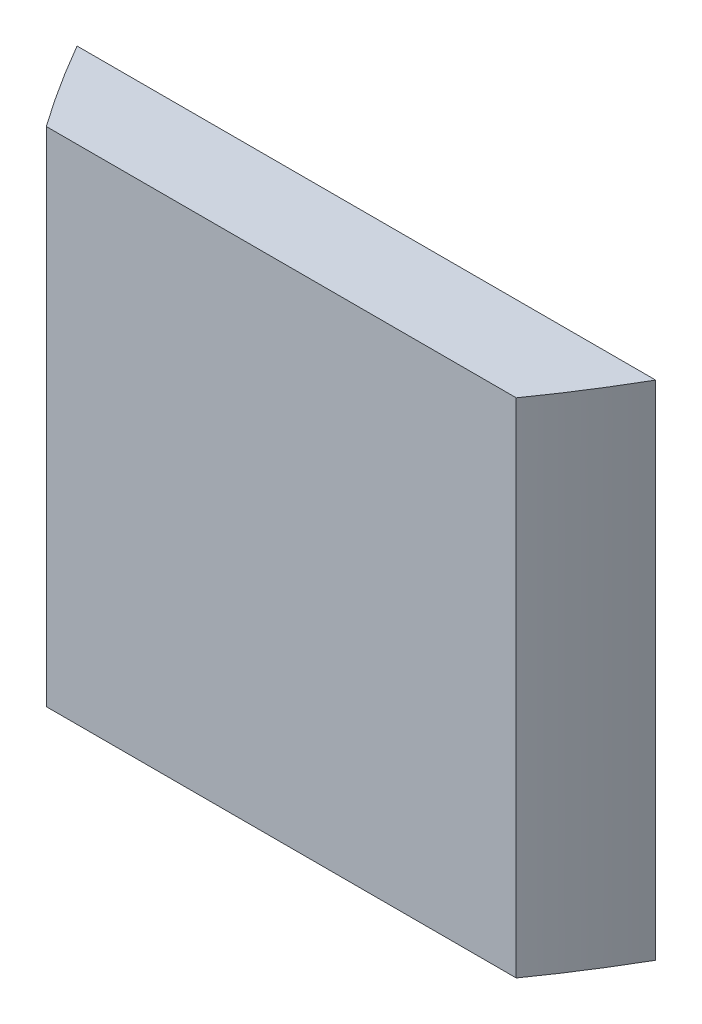
ISO-10303-21;
HEADER;
FILE_DESCRIPTION(('STEP AP214'),'2;1');
FILE_NAME('part.step','',(''),(''),'','','');
FILE_SCHEMA(('AUTOMOTIVE_DESIGN { 1 0 10303 214 1 1 1 1 }'));
ENDSEC;
DATA;
#1=APPLICATION_CONTEXT('core data for automotive mechanical design processes');
#2=APPLICATION_PROTOCOL_DEFINITION('international standard','automotive_design',2000,#1);
#3=PRODUCT_CONTEXT('',#1,'mechanical');
#4=PRODUCT('Part','Part','',(#3));
#5=PRODUCT_RELATED_PRODUCT_CATEGORY('part','',(#4));
#6=PRODUCT_DEFINITION_FORMATION('','',#4);
#7=PRODUCT_DEFINITION_CONTEXT('part definition',#1,'design');
#8=PRODUCT_DEFINITION('design','',#6,#7);
#9=PRODUCT_DEFINITION_SHAPE('','',#8);
#10=(LENGTH_UNIT() NAMED_UNIT(*) SI_UNIT(.MILLI.,.METRE.));
#11=(NAMED_UNIT(*) PLANE_ANGLE_UNIT() SI_UNIT($,.RADIAN.));
#12=(NAMED_UNIT(*) SI_UNIT($,.STERADIAN.) SOLID_ANGLE_UNIT());
#13=UNCERTAINTY_MEASURE_WITH_UNIT(LENGTH_MEASURE(1.E-05),#10,'distance_accuracy_value','');
#14=(GEOMETRIC_REPRESENTATION_CONTEXT(3) GLOBAL_UNCERTAINTY_ASSIGNED_CONTEXT((#13)) GLOBAL_UNIT_ASSIGNED_CONTEXT((#10,
#11,#12)) REPRESENTATION_CONTEXT('',''));
#15=CARTESIAN_POINT('',(0.,0.,0.));
#16=DIRECTION('',(0.,0.,1.));
#17=DIRECTION('',(1.,0.,0.));
#18=AXIS2_PLACEMENT_3D('',#15,#16,#17);
#19=CARTESIAN_POINT('',(-200.000000000337,300.,-6.70196537155832E-10));
#20=CARTESIAN_POINT('',(-5.91540705308091E-11,300.,400.000000000552));
#21=CARTESIAN_POINT('',(200.000000000219,300.,-4.34305369445553E-10));
#22=B_SPLINE_CURVE_WITH_KNOTS('',2,(#19,#20,#21),.UNSPECIFIED.,.F.,.F.,(3,3),(0.056028396232078,
0.943971603767659),.UNSPECIFIED.);
#23=DIRECTION('',(0.,-1.,0.));
#24=VECTOR('',#23,1.);
#25=SURFACE_OF_LINEAR_EXTRUSION('',#22,#24);
#26=CARTESIAN_POINT('',(-200.000000000337,0.,-6.70196537155832E-10));
#27=CARTESIAN_POINT('',(-5.91540705308091E-11,0.,400.000000000552));
#28=CARTESIAN_POINT('',(200.000000000219,0.,-4.34305369445553E-10));
#29=B_SPLINE_CURVE_WITH_KNOTS('',2,(#26,#27,#28),.UNSPECIFIED.,.F.,.F.,(3,3),(0.056028396232078,
0.943971603767659),.UNSPECIFIED.);
#30=CARTESIAN_POINT('',(-172.742583042524,0.,50.7999999994648));
#31=VERTEX_POINT('',#30);
#32=CARTESIAN_POINT('',(-140.285423334384,0.,101.599999999465));
#33=VERTEX_POINT('',#32);
#34=EDGE_CURVE('E89',#31,#33,#29,.T.);
#35=ORIENTED_EDGE('',*,*,#34,.T.);
#36=DIRECTION('',(0.,-1.,0.));
#37=VECTOR('',#36,1.);
#38=CARTESIAN_POINT('',(-140.285423334385,300.,101.599999999465));
#39=LINE('',#38,#37);
#40=CARTESIAN_POINT('',(-140.285423334384,300.,101.599999999465));
#41=VERTEX_POINT('',#40);
#42=EDGE_CURVE('E48',#33,#41,#39,.F.);
#43=ORIENTED_EDGE('',*,*,#42,.T.);
#44=CARTESIAN_POINT('',(-172.742583042524,300.,50.7999999994648));
#45=VERTEX_POINT('',#44);
#46=EDGE_CURVE('E86',#45,#41,#22,.T.);
#47=ORIENTED_EDGE('',*,*,#46,.F.);
#48=DIRECTION('',(0.,-1.,0.));
#49=VECTOR('',#48,1.);
#50=CARTESIAN_POINT('',(-172.742583053825,300.,50.7999999994648));
#51=LINE('',#50,#49);
#52=EDGE_CURVE('E96',#45,#31,#51,.T.);
#53=ORIENTED_EDGE('',*,*,#52,.T.);
#54=EDGE_LOOP('',(#35,#43,#47,#53));
#55=FACE_BOUND('',#54,.T.);
#56=ADVANCED_FACE('F33',(#55),#25,.F.);
#57=CARTESIAN_POINT('',(140.285423334384,300.,101.599999999465));
#58=VERTEX_POINT('',#57);
#59=CARTESIAN_POINT('',(172.742583042523,300.,50.7999999994648));
#60=VERTEX_POINT('',#59);
#61=EDGE_CURVE('E83',#58,#60,#22,.T.);
#62=ORIENTED_EDGE('',*,*,#61,.F.);
#63=DIRECTION('',(0.,-1.,0.));
#64=VECTOR('',#63,1.);
#65=CARTESIAN_POINT('',(140.285423334384,300.,101.599999999465));
#66=LINE('',#65,#64);
#67=CARTESIAN_POINT('',(140.285423334384,0.,101.599999999465));
#68=VERTEX_POINT('',#67);
#69=EDGE_CURVE('E73',#58,#68,#66,.T.);
#70=ORIENTED_EDGE('',*,*,#69,.T.);
#71=CARTESIAN_POINT('',(172.742583042523,0.,50.8000000189873));
#72=VERTEX_POINT('',#71);
#73=EDGE_CURVE('E56',#68,#72,#29,.T.);
#74=ORIENTED_EDGE('',*,*,#73,.T.);
#75=DIRECTION('',(0.,-1.,0.));
#76=VECTOR('',#75,1.);
#77=CARTESIAN_POINT('',(172.742583053825,300.,50.7999999994648));
#78=LINE('',#77,#76);
#79=EDGE_CURVE('E88',#72,#60,#78,.F.);
#80=ORIENTED_EDGE('',*,*,#79,.T.);
#81=EDGE_LOOP('',(#62,#70,#74,#80));
#82=FACE_BOUND('',#81,.T.);
#83=ADVANCED_FACE('F35',(#82),#25,.F.);
#84=CARTESIAN_POINT('',(-5.9161009424713E-11,300.,200.));
#85=DIRECTION('',(0.,-1.,0.));
#86=DIRECTION('',(0.,0.,-1.));
#87=AXIS2_PLACEMENT_3D('',#84,#85,#86);
#88=PLANE('',#87);
#89=ORIENTED_EDGE('',*,*,#46,.T.);
#90=DIRECTION('',(-1.,0.,0.));
#91=VECTOR('',#90,1.);
#92=CARTESIAN_POINT('',(-221.417293167124,300.,101.599999999465));
#93=LINE('',#92,#91);
#94=EDGE_CURVE('E76',#58,#41,#93,.T.);
#95=ORIENTED_EDGE('',*,*,#94,.F.);
#96=ORIENTED_EDGE('',*,*,#61,.T.);
#97=DIRECTION('',(1.,0.,0.));
#98=VECTOR('',#97,1.);
#99=CARTESIAN_POINT('',(-222.676725495858,300.,50.7999999994648));
#100=LINE('',#99,#98);
#101=EDGE_CURVE('E159',#45,#60,#100,.T.);
#102=ORIENTED_EDGE('',*,*,#101,.F.);
#103=EDGE_LOOP('',(#89,#95,#96,#102));
#104=FACE_BOUND('',#103,.T.);
#105=ADVANCED_FACE('F81',(#104),#88,.F.);
#106=CARTESIAN_POINT('',(-5.9161009424713E-11,0.,200.));
#107=DIRECTION('',(0.,-1.,0.));
#108=DIRECTION('',(0.,0.,-1.));
#109=AXIS2_PLACEMENT_3D('',#106,#107,#108);
#110=PLANE('',#109);
#111=DIRECTION('',(1.,0.,0.));
#112=VECTOR('',#111,1.);
#113=CARTESIAN_POINT('',(-5.9161009424713E-11,0.,101.599999999465));
#114=LINE('',#113,#112);
#115=EDGE_CURVE('E11',#33,#68,#114,.T.);
#116=ORIENTED_EDGE('',*,*,#115,.F.);
#117=ORIENTED_EDGE('',*,*,#34,.F.);
#118=DIRECTION('',(-1.,0.,0.));
#119=VECTOR('',#118,1.);
#120=CARTESIAN_POINT('',(-5.9161009424713E-11,0.,50.7999999994648));
#121=LINE('',#120,#119);
#122=EDGE_CURVE('E42',#72,#31,#121,.T.);
#123=ORIENTED_EDGE('',*,*,#122,.F.);
#124=ORIENTED_EDGE('',*,*,#73,.F.);
#125=EDGE_LOOP('',(#116,#117,#123,#124));
#126=FACE_BOUND('',#125,.T.);
#127=ADVANCED_FACE('F113',(#126),#110,.T.);
#128=CARTESIAN_POINT('',(-222.676725495858,-50.,50.7999999994648));
#129=DIRECTION('',(0.,0.,1.));
#130=DIRECTION('',(1.,0.,0.));
#131=AXIS2_PLACEMENT_3D('',#128,#129,#130);
#132=PLANE('',#131);
#133=ORIENTED_EDGE('',*,*,#101,.T.);
#134=ORIENTED_EDGE('',*,*,#79,.F.);
#135=ORIENTED_EDGE('',*,*,#122,.T.);
#136=ORIENTED_EDGE('',*,*,#52,.F.);
#137=EDGE_LOOP('',(#133,#134,#135,#136));
#138=FACE_BOUND('',#137,.T.);
#139=ADVANCED_FACE('F109',(#138),#132,.F.);
#140=CARTESIAN_POINT('',(-221.417293167124,-50.,101.599999999465));
#141=DIRECTION('',(0.,0.,-1.));
#142=DIRECTION('',(-1.,0.,0.));
#143=AXIS2_PLACEMENT_3D('',#140,#141,#142);
#144=PLANE('',#143);
#145=ORIENTED_EDGE('',*,*,#115,.T.);
#146=ORIENTED_EDGE('',*,*,#69,.F.);
#147=ORIENTED_EDGE('',*,*,#94,.T.);
#148=ORIENTED_EDGE('',*,*,#42,.F.);
#149=EDGE_LOOP('',(#145,#146,#147,#148));
#150=FACE_BOUND('',#149,.T.);
#151=ADVANCED_FACE('F75',(#150),#144,.F.);
#152=CLOSED_SHELL('',(#56,#83,#105,#127,#139,#151));
#153=MANIFOLD_SOLID_BREP('B2',#152);
#154=ADVANCED_BREP_SHAPE_REPRESENTATION('',(#18,#153),#14);
#155=SHAPE_DEFINITION_REPRESENTATION(#9,#154);
ENDSEC;
END-ISO-10303-21;
